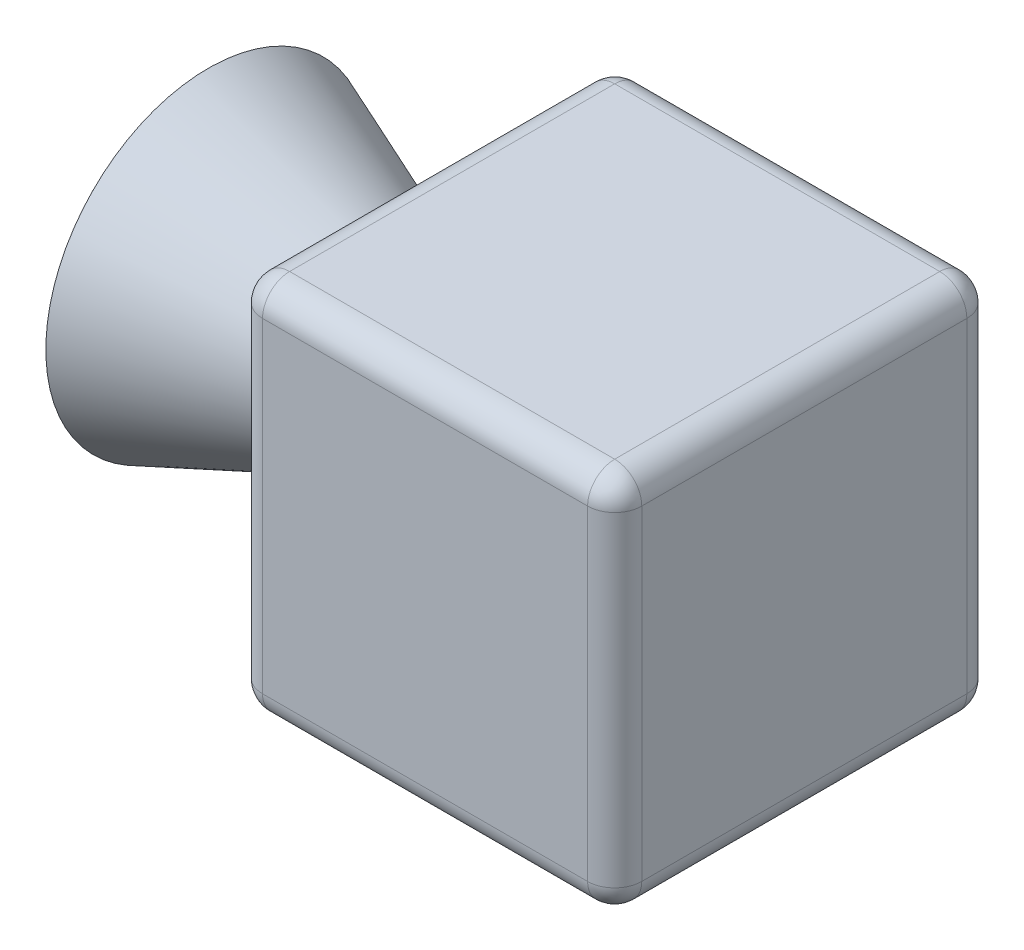
ISO-10303-21;
HEADER;
FILE_DESCRIPTION(('STEP AP214'),'2;1');
FILE_NAME('part.step','',(''),(''),'','','');
FILE_SCHEMA(('AUTOMOTIVE_DESIGN { 1 0 10303 214 1 1 1 1 }'));
ENDSEC;
DATA;
#1=APPLICATION_CONTEXT('core data for automotive mechanical design processes');
#2=APPLICATION_PROTOCOL_DEFINITION('international standard','automotive_design',2000,#1);
#3=PRODUCT_CONTEXT('',#1,'mechanical');
#4=PRODUCT('Part','Part','',(#3));
#5=PRODUCT_RELATED_PRODUCT_CATEGORY('part','',(#4));
#6=PRODUCT_DEFINITION_FORMATION('','',#4);
#7=PRODUCT_DEFINITION_CONTEXT('part definition',#1,'design');
#8=PRODUCT_DEFINITION('design','',#6,#7);
#9=PRODUCT_DEFINITION_SHAPE('','',#8);
#10=(LENGTH_UNIT() NAMED_UNIT(*) SI_UNIT(.MILLI.,.METRE.));
#11=(NAMED_UNIT(*) PLANE_ANGLE_UNIT() SI_UNIT($,.RADIAN.));
#12=(NAMED_UNIT(*) SI_UNIT($,.STERADIAN.) SOLID_ANGLE_UNIT());
#13=UNCERTAINTY_MEASURE_WITH_UNIT(LENGTH_MEASURE(1.E-05),#10,'distance_accuracy_value','');
#14=(GEOMETRIC_REPRESENTATION_CONTEXT(3) GLOBAL_UNCERTAINTY_ASSIGNED_CONTEXT((#13)) GLOBAL_UNIT_ASSIGNED_CONTEXT((#10,
#11,#12)) REPRESENTATION_CONTEXT('',''));
#15=CARTESIAN_POINT('',(0.,0.,0.));
#16=DIRECTION('',(0.,0.,1.));
#17=DIRECTION('',(1.,0.,0.));
#18=AXIS2_PLACEMENT_3D('',#15,#16,#17);
#19=CARTESIAN_POINT('',(-7.,0.,0.));
#20=DIRECTION('',(-1.,0.,0.));
#21=DIRECTION('',(0.,0.,1.));
#22=AXIS2_PLACEMENT_3D('',#19,#20,#21);
#23=CONICAL_SURFACE('',#22,2.8,0.380506377112365);
#24=CARTESIAN_POINT('',(-15.,0.,0.));
#25=DIRECTION('',(1.,0.,0.));
#26=DIRECTION('',(0.,0.,-1.));
#27=AXIS2_PLACEMENT_3D('',#24,#25,#26);
#28=CIRCLE('',#27,6.);
#29=CARTESIAN_POINT('',(-15.,0.,-6.));
#30=VERTEX_POINT('',#29);
#31=EDGE_CURVE('E155',#30,#30,#28,.T.);
#32=ORIENTED_EDGE('',*,*,#31,.T.);
#33=EDGE_LOOP('',(#32));
#34=FACE_BOUND('',#33,.T.);
#35=CARTESIAN_POINT('',(-7.,0.,0.));
#36=DIRECTION('',(1.,0.,0.));
#37=DIRECTION('',(0.,0.,-1.));
#38=AXIS2_PLACEMENT_3D('',#35,#36,#37);
#39=CIRCLE('',#38,2.8);
#40=CARTESIAN_POINT('',(-7.,0.,-2.8));
#41=VERTEX_POINT('',#40);
#42=EDGE_CURVE('E261',#41,#41,#39,.T.);
#43=ORIENTED_EDGE('',*,*,#42,.F.);
#44=EDGE_LOOP('',(#43));
#45=FACE_BOUND('',#44,.T.);
#46=ADVANCED_FACE('F38',(#34,#45),#23,.T.);
#47=CARTESIAN_POINT('',(-7.,0.,0.));
#48=DIRECTION('',(1.,0.,0.));
#49=DIRECTION('',(0.,0.,-1.));
#50=AXIS2_PLACEMENT_3D('',#47,#48,#49);
#51=SPHERICAL_SURFACE('',#50,10.);
#52=ORIENTED_EDGE('',*,*,#31,.F.);
#53=EDGE_LOOP('',(#52));
#54=FACE_BOUND('',#53,.T.);
#55=ADVANCED_FACE('F275',(#54),#51,.T.);
#56=CARTESIAN_POINT('',(0.,7.,7.));
#57=DIRECTION('',(0.,0.,-1.));
#58=DIRECTION('',(-1.,0.,0.));
#59=AXIS2_PLACEMENT_3D('',#56,#57,#58);
#60=PLANE('',#59);
#61=DIRECTION('',(1.,0.,0.));
#62=VECTOR('',#61,1.);
#63=CARTESIAN_POINT('',(-7.,6.,7.));
#64=LINE('',#63,#62);
#65=CARTESIAN_POINT('',(6.,6.,7.));
#66=VERTEX_POINT('',#65);
#67=CARTESIAN_POINT('',(-6.,6.,7.));
#68=VERTEX_POINT('',#67);
#69=EDGE_CURVE('E195',#66,#68,#64,.F.);
#70=ORIENTED_EDGE('',*,*,#69,.T.);
#71=DIRECTION('',(0.,-1.,0.));
#72=VECTOR('',#71,1.);
#73=CARTESIAN_POINT('',(-6.,-7.,7.));
#74=LINE('',#73,#72);
#75=CARTESIAN_POINT('',(-6.,-6.,7.));
#76=VERTEX_POINT('',#75);
#77=EDGE_CURVE('E197',#68,#76,#74,.T.);
#78=ORIENTED_EDGE('',*,*,#77,.T.);
#79=DIRECTION('',(1.,0.,0.));
#80=VECTOR('',#79,1.);
#81=CARTESIAN_POINT('',(0.,-6.,7.));
#82=LINE('',#81,#80);
#83=CARTESIAN_POINT('',(6.,-6.,7.));
#84=VERTEX_POINT('',#83);
#85=EDGE_CURVE('E191',#76,#84,#82,.T.);
#86=ORIENTED_EDGE('',*,*,#85,.T.);
#87=DIRECTION('',(0.,-1.,0.));
#88=VECTOR('',#87,1.);
#89=CARTESIAN_POINT('',(6.,7.,7.));
#90=LINE('',#89,#88);
#91=EDGE_CURVE('E193',#84,#66,#90,.F.);
#92=ORIENTED_EDGE('',*,*,#91,.T.);
#93=EDGE_LOOP('',(#70,#78,#86,#92));
#94=FACE_BOUND('',#93,.T.);
#95=ADVANCED_FACE('F277',(#94),#60,.F.);
#96=CARTESIAN_POINT('',(7.,7.,0.));
#97=DIRECTION('',(-1.,0.,0.));
#98=DIRECTION('',(0.,0.,1.));
#99=AXIS2_PLACEMENT_3D('',#96,#97,#98);
#100=PLANE('',#99);
#101=DIRECTION('',(0.,0.,-1.));
#102=VECTOR('',#101,1.);
#103=CARTESIAN_POINT('',(7.,6.,7.));
#104=LINE('',#103,#102);
#105=CARTESIAN_POINT('',(7.,6.,-6.));
#106=VERTEX_POINT('',#105);
#107=CARTESIAN_POINT('',(7.,6.,6.));
#108=VERTEX_POINT('',#107);
#109=EDGE_CURVE('E177',#106,#108,#104,.F.);
#110=ORIENTED_EDGE('',*,*,#109,.T.);
#111=DIRECTION('',(0.,-1.,0.));
#112=VECTOR('',#111,1.);
#113=CARTESIAN_POINT('',(7.,7.,6.));
#114=LINE('',#113,#112);
#115=CARTESIAN_POINT('',(7.,-6.,6.));
#116=VERTEX_POINT('',#115);
#117=EDGE_CURVE('E180',#108,#116,#114,.T.);
#118=ORIENTED_EDGE('',*,*,#117,.T.);
#119=DIRECTION('',(0.,0.,-1.));
#120=VECTOR('',#119,1.);
#121=CARTESIAN_POINT('',(7.,-6.,0.));
#122=LINE('',#121,#120);
#123=CARTESIAN_POINT('',(7.,-6.,-6.));
#124=VERTEX_POINT('',#123);
#125=EDGE_CURVE('E175',#116,#124,#122,.T.);
#126=ORIENTED_EDGE('',*,*,#125,.T.);
#127=DIRECTION('',(0.,-1.,0.));
#128=VECTOR('',#127,1.);
#129=CARTESIAN_POINT('',(7.,7.,-6.));
#130=LINE('',#129,#128);
#131=EDGE_CURVE('E173',#124,#106,#130,.F.);
#132=ORIENTED_EDGE('',*,*,#131,.T.);
#133=EDGE_LOOP('',(#110,#118,#126,#132));
#134=FACE_BOUND('',#133,.T.);
#135=ADVANCED_FACE('F283',(#134),#100,.F.);
#136=CARTESIAN_POINT('',(0.,7.,-7.));
#137=DIRECTION('',(0.,0.,-1.));
#138=DIRECTION('',(-1.,0.,0.));
#139=AXIS2_PLACEMENT_3D('',#136,#137,#138);
#140=PLANE('',#139);
#141=DIRECTION('',(1.,0.,0.));
#142=VECTOR('',#141,1.);
#143=CARTESIAN_POINT('',(0.,6.,-7.));
#144=LINE('',#143,#142);
#145=CARTESIAN_POINT('',(-6.,6.,-7.));
#146=VERTEX_POINT('',#145);
#147=CARTESIAN_POINT('',(6.,6.,-7.));
#148=VERTEX_POINT('',#147);
#149=EDGE_CURVE('E47',#146,#148,#144,.T.);
#150=ORIENTED_EDGE('',*,*,#149,.T.);
#151=DIRECTION('',(0.,-1.,0.));
#152=VECTOR('',#151,1.);
#153=CARTESIAN_POINT('',(6.,-7.,-7.));
#154=LINE('',#153,#152);
#155=CARTESIAN_POINT('',(6.,-6.,-7.));
#156=VERTEX_POINT('',#155);
#157=EDGE_CURVE('E11',#148,#156,#154,.T.);
#158=ORIENTED_EDGE('',*,*,#157,.T.);
#159=DIRECTION('',(1.,0.,0.));
#160=VECTOR('',#159,1.);
#161=CARTESIAN_POINT('',(-7.,-6.,-7.));
#162=LINE('',#161,#160);
#163=CARTESIAN_POINT('',(-6.,-6.,-7.));
#164=VERTEX_POINT('',#163);
#165=EDGE_CURVE('E200',#156,#164,#162,.F.);
#166=ORIENTED_EDGE('',*,*,#165,.T.);
#167=DIRECTION('',(0.,-1.,0.));
#168=VECTOR('',#167,1.);
#169=CARTESIAN_POINT('',(-6.,7.,-7.));
#170=LINE('',#169,#168);
#171=EDGE_CURVE('E58',#164,#146,#170,.F.);
#172=ORIENTED_EDGE('',*,*,#171,.T.);
#173=EDGE_LOOP('',(#150,#158,#166,#172));
#174=FACE_BOUND('',#173,.T.);
#175=ADVANCED_FACE('F386',(#174),#140,.T.);
#176=CARTESIAN_POINT('',(-7.,7.,0.));
#177=DIRECTION('',(-1.,0.,0.));
#178=DIRECTION('',(0.,0.,1.));
#179=AXIS2_PLACEMENT_3D('',#176,#177,#178);
#180=PLANE('',#179);
#181=DIRECTION('',(0.,0.,-1.));
#182=VECTOR('',#181,1.);
#183=CARTESIAN_POINT('',(-7.,-6.,7.));
#184=LINE('',#183,#182);
#185=CARTESIAN_POINT('',(-7.,-6.,-6.));
#186=VERTEX_POINT('',#185);
#187=CARTESIAN_POINT('',(-7.,-6.,6.));
#188=VERTEX_POINT('',#187);
#189=EDGE_CURVE('E154',#186,#188,#184,.F.);
#190=ORIENTED_EDGE('',*,*,#189,.T.);
#191=DIRECTION('',(0.,-1.,0.));
#192=VECTOR('',#191,1.);
#193=CARTESIAN_POINT('',(-7.,7.,6.));
#194=LINE('',#193,#192);
#195=CARTESIAN_POINT('',(-7.,6.,6.));
#196=VERTEX_POINT('',#195);
#197=EDGE_CURVE('E160',#188,#196,#194,.F.);
#198=ORIENTED_EDGE('',*,*,#197,.T.);
#199=DIRECTION('',(0.,0.,-1.));
#200=VECTOR('',#199,1.);
#201=CARTESIAN_POINT('',(-7.,6.,0.));
#202=LINE('',#201,#200);
#203=CARTESIAN_POINT('',(-7.,6.,-6.));
#204=VERTEX_POINT('',#203);
#205=EDGE_CURVE('E131',#196,#204,#202,.T.);
#206=ORIENTED_EDGE('',*,*,#205,.T.);
#207=DIRECTION('',(0.,-1.,0.));
#208=VECTOR('',#207,1.);
#209=CARTESIAN_POINT('',(-7.,7.,-6.));
#210=LINE('',#209,#208);
#211=EDGE_CURVE('E148',#204,#186,#210,.T.);
#212=ORIENTED_EDGE('',*,*,#211,.T.);
#213=EDGE_LOOP('',(#190,#198,#206,#212));
#214=FACE_BOUND('',#213,.T.);
#215=ORIENTED_EDGE('',*,*,#42,.T.);
#216=EDGE_LOOP('',(#215));
#217=FACE_BOUND('',#216,.T.);
#218=ADVANCED_FACE('F157',(#214,#217),#180,.T.);
#219=CARTESIAN_POINT('',(0.,7.,0.));
#220=DIRECTION('',(0.,1.,0.));
#221=DIRECTION('',(0.,0.,1.));
#222=AXIS2_PLACEMENT_3D('',#219,#220,#221);
#223=PLANE('',#222);
#224=DIRECTION('',(0.,0.,-1.));
#225=VECTOR('',#224,1.);
#226=CARTESIAN_POINT('',(-6.,7.,0.));
#227=LINE('',#226,#225);
#228=CARTESIAN_POINT('',(-6.,7.,-6.));
#229=VERTEX_POINT('',#228);
#230=CARTESIAN_POINT('',(-6.,7.,6.));
#231=VERTEX_POINT('',#230);
#232=EDGE_CURVE('E133',#229,#231,#227,.F.);
#233=ORIENTED_EDGE('',*,*,#232,.T.);
#234=DIRECTION('',(1.,0.,0.));
#235=VECTOR('',#234,1.);
#236=CARTESIAN_POINT('',(7.,7.,6.));
#237=LINE('',#236,#235);
#238=CARTESIAN_POINT('',(6.,7.,6.));
#239=VERTEX_POINT('',#238);
#240=EDGE_CURVE('E171',#231,#239,#237,.T.);
#241=ORIENTED_EDGE('',*,*,#240,.T.);
#242=DIRECTION('',(0.,0.,-1.));
#243=VECTOR('',#242,1.);
#244=CARTESIAN_POINT('',(6.,7.,-7.));
#245=LINE('',#244,#243);
#246=CARTESIAN_POINT('',(6.,7.,-6.));
#247=VERTEX_POINT('',#246);
#248=EDGE_CURVE('E168',#239,#247,#245,.T.);
#249=ORIENTED_EDGE('',*,*,#248,.T.);
#250=DIRECTION('',(1.,0.,0.));
#251=VECTOR('',#250,1.);
#252=CARTESIAN_POINT('',(0.,7.,-6.));
#253=LINE('',#252,#251);
#254=EDGE_CURVE('E163',#247,#229,#253,.F.);
#255=ORIENTED_EDGE('',*,*,#254,.T.);
#256=EDGE_LOOP('',(#233,#241,#249,#255));
#257=FACE_BOUND('',#256,.T.);
#258=ADVANCED_FACE('F380',(#257),#223,.T.);
#259=CARTESIAN_POINT('',(0.,-7.,0.));
#260=DIRECTION('',(0.,1.,0.));
#261=DIRECTION('',(0.,0.,1.));
#262=AXIS2_PLACEMENT_3D('',#259,#260,#261);
#263=PLANE('',#262);
#264=DIRECTION('',(0.,0.,-1.));
#265=VECTOR('',#264,1.);
#266=CARTESIAN_POINT('',(6.,-7.,0.));
#267=LINE('',#266,#265);
#268=CARTESIAN_POINT('',(6.,-7.,-6.));
#269=VERTEX_POINT('',#268);
#270=CARTESIAN_POINT('',(6.,-7.,6.));
#271=VERTEX_POINT('',#270);
#272=EDGE_CURVE('E186',#269,#271,#267,.F.);
#273=ORIENTED_EDGE('',*,*,#272,.T.);
#274=DIRECTION('',(1.,0.,0.));
#275=VECTOR('',#274,1.);
#276=CARTESIAN_POINT('',(0.,-7.,6.));
#277=LINE('',#276,#275);
#278=CARTESIAN_POINT('',(-6.,-7.,6.));
#279=VERTEX_POINT('',#278);
#280=EDGE_CURVE('E189',#271,#279,#277,.F.);
#281=ORIENTED_EDGE('',*,*,#280,.T.);
#282=DIRECTION('',(0.,0.,-1.));
#283=VECTOR('',#282,1.);
#284=CARTESIAN_POINT('',(-6.,-7.,-7.));
#285=LINE('',#284,#283);
#286=CARTESIAN_POINT('',(-6.,-7.,-6.));
#287=VERTEX_POINT('',#286);
#288=EDGE_CURVE('E184',#279,#287,#285,.T.);
#289=ORIENTED_EDGE('',*,*,#288,.T.);
#290=DIRECTION('',(1.,0.,0.));
#291=VECTOR('',#290,1.);
#292=CARTESIAN_POINT('',(7.,-7.,-6.));
#293=LINE('',#292,#291);
#294=EDGE_CURVE('E182',#287,#269,#293,.T.);
#295=ORIENTED_EDGE('',*,*,#294,.T.);
#296=EDGE_LOOP('',(#273,#281,#289,#295));
#297=FACE_BOUND('',#296,.T.);
#298=ADVANCED_FACE('F358',(#297),#263,.F.);
#299=CARTESIAN_POINT('',(6.,-6.,0.));
#300=DIRECTION('',(0.,0.,-1.));
#301=DIRECTION('',(-1.,0.,0.));
#302=AXIS2_PLACEMENT_3D('',#299,#300,#301);
#303=CYLINDRICAL_SURFACE('',#302,1.);
#304=CARTESIAN_POINT('',(6.,-6.,6.));
#305=DIRECTION('',(0.,0.,1.));
#306=DIRECTION('',(1.,0.,0.));
#307=AXIS2_PLACEMENT_3D('',#304,#305,#306);
#308=CIRCLE('',#307,1.);
#309=EDGE_CURVE('E42',#271,#116,#308,.T.);
#310=ORIENTED_EDGE('',*,*,#309,.F.);
#311=ORIENTED_EDGE('',*,*,#272,.F.);
#312=CARTESIAN_POINT('',(6.,-6.,-6.));
#313=DIRECTION('',(0.,0.,-1.));
#314=DIRECTION('',(-1.,0.,0.));
#315=AXIS2_PLACEMENT_3D('',#312,#313,#314);
#316=CIRCLE('',#315,1.);
#317=EDGE_CURVE('E254',#124,#269,#316,.T.);
#318=ORIENTED_EDGE('',*,*,#317,.F.);
#319=ORIENTED_EDGE('',*,*,#125,.F.);
#320=EDGE_LOOP('',(#310,#311,#318,#319));
#321=FACE_BOUND('',#320,.T.);
#322=ADVANCED_FACE('F40',(#321),#303,.T.);
#323=CARTESIAN_POINT('',(6.,-6.,6.));
#324=DIRECTION('',(0.,0.,1.));
#325=DIRECTION('',(1.,0.,0.));
#326=AXIS2_PLACEMENT_3D('',#323,#324,#325);
#327=SPHERICAL_SURFACE('',#326,1.);
#328=CARTESIAN_POINT('',(6.,-6.,6.));
#329=DIRECTION('',(1.,0.,0.));
#330=DIRECTION('',(0.,0.,-1.));
#331=AXIS2_PLACEMENT_3D('',#328,#329,#330);
#332=CIRCLE('',#331,1.);
#333=EDGE_CURVE('E249',#271,#84,#332,.F.);
#334=ORIENTED_EDGE('',*,*,#333,.F.);
#335=ORIENTED_EDGE('',*,*,#309,.T.);
#336=CARTESIAN_POINT('',(6.,-6.,6.));
#337=DIRECTION('',(0.,-1.,0.));
#338=DIRECTION('',(0.,0.,-1.));
#339=AXIS2_PLACEMENT_3D('',#336,#337,#338);
#340=CIRCLE('',#339,1.);
#341=EDGE_CURVE('E252',#84,#116,#340,.F.);
#342=ORIENTED_EDGE('',*,*,#341,.F.);
#343=EDGE_LOOP('',(#334,#335,#342));
#344=FACE_BOUND('',#343,.T.);
#345=ADVANCED_FACE('F353',(#344),#327,.T.);
#346=CARTESIAN_POINT('',(6.,-6.,-6.));
#347=DIRECTION('',(0.,0.,1.));
#348=DIRECTION('',(1.,0.,0.));
#349=AXIS2_PLACEMENT_3D('',#346,#347,#348);
#350=SPHERICAL_SURFACE('',#349,1.);
#351=CARTESIAN_POINT('',(6.,-6.,-6.));
#352=DIRECTION('',(0.,-1.,0.));
#353=DIRECTION('',(1.,0.,0.));
#354=AXIS2_PLACEMENT_3D('',#351,#352,#353);
#355=CIRCLE('',#354,1.);
#356=EDGE_CURVE('E243',#124,#156,#355,.F.);
#357=ORIENTED_EDGE('',*,*,#356,.F.);
#358=ORIENTED_EDGE('',*,*,#317,.T.);
#359=CARTESIAN_POINT('',(6.,-6.,-6.));
#360=DIRECTION('',(1.,0.,0.));
#361=DIRECTION('',(0.,0.,-1.));
#362=AXIS2_PLACEMENT_3D('',#359,#360,#361);
#363=CIRCLE('',#362,1.);
#364=EDGE_CURVE('E246',#156,#269,#363,.F.);
#365=ORIENTED_EDGE('',*,*,#364,.F.);
#366=EDGE_LOOP('',(#357,#358,#365));
#367=FACE_BOUND('',#366,.T.);
#368=ADVANCED_FACE('F350',(#367),#350,.T.);
#369=CARTESIAN_POINT('',(6.,7.,6.));
#370=DIRECTION('',(0.,-1.,0.));
#371=DIRECTION('',(0.,0.,-1.));
#372=AXIS2_PLACEMENT_3D('',#369,#370,#371);
#373=CYLINDRICAL_SURFACE('',#372,1.);
#374=ORIENTED_EDGE('',*,*,#341,.T.);
#375=ORIENTED_EDGE('',*,*,#117,.F.);
#376=CARTESIAN_POINT('',(6.,6.,6.));
#377=DIRECTION('',(0.,1.,0.));
#378=DIRECTION('',(0.,0.,1.));
#379=AXIS2_PLACEMENT_3D('',#376,#377,#378);
#380=CIRCLE('',#379,1.);
#381=EDGE_CURVE('E238',#66,#108,#380,.T.);
#382=ORIENTED_EDGE('',*,*,#381,.F.);
#383=ORIENTED_EDGE('',*,*,#91,.F.);
#384=EDGE_LOOP('',(#374,#375,#382,#383));
#385=FACE_BOUND('',#384,.T.);
#386=ADVANCED_FACE('F346',(#385),#373,.T.);
#387=CARTESIAN_POINT('',(0.,-6.,6.));
#388=DIRECTION('',(1.,0.,0.));
#389=DIRECTION('',(0.,0.,-1.));
#390=AXIS2_PLACEMENT_3D('',#387,#388,#389);
#391=CYLINDRICAL_SURFACE('',#390,1.);
#392=ORIENTED_EDGE('',*,*,#333,.T.);
#393=ORIENTED_EDGE('',*,*,#85,.F.);
#394=CARTESIAN_POINT('',(-6.,-6.,6.));
#395=DIRECTION('',(-1.,0.,0.));
#396=DIRECTION('',(0.,0.,1.));
#397=AXIS2_PLACEMENT_3D('',#394,#395,#396);
#398=CIRCLE('',#397,1.);
#399=EDGE_CURVE('E235',#279,#76,#398,.T.);
#400=ORIENTED_EDGE('',*,*,#399,.F.);
#401=ORIENTED_EDGE('',*,*,#280,.F.);
#402=EDGE_LOOP('',(#392,#393,#400,#401));
#403=FACE_BOUND('',#402,.T.);
#404=ADVANCED_FACE('F342',(#403),#391,.T.);
#405=CARTESIAN_POINT('',(-6.,-6.,0.));
#406=DIRECTION('',(0.,0.,1.));
#407=DIRECTION('',(1.,0.,0.));
#408=AXIS2_PLACEMENT_3D('',#405,#406,#407);
#409=CYLINDRICAL_SURFACE('',#408,1.);
#410=CARTESIAN_POINT('',(-6.,-6.,-6.));
#411=DIRECTION('',(0.,0.,-1.));
#412=DIRECTION('',(-1.,0.,0.));
#413=AXIS2_PLACEMENT_3D('',#410,#411,#412);
#414=CIRCLE('',#413,1.);
#415=EDGE_CURVE('E229',#287,#186,#414,.T.);
#416=ORIENTED_EDGE('',*,*,#415,.F.);
#417=ORIENTED_EDGE('',*,*,#288,.F.);
#418=CARTESIAN_POINT('',(-6.,-6.,6.));
#419=DIRECTION('',(0.,0.,1.));
#420=DIRECTION('',(1.,0.,0.));
#421=AXIS2_PLACEMENT_3D('',#418,#419,#420);
#422=CIRCLE('',#421,1.);
#423=EDGE_CURVE('E232',#188,#279,#422,.T.);
#424=ORIENTED_EDGE('',*,*,#423,.F.);
#425=ORIENTED_EDGE('',*,*,#189,.F.);
#426=EDGE_LOOP('',(#416,#417,#424,#425));
#427=FACE_BOUND('',#426,.T.);
#428=ADVANCED_FACE('F338',(#427),#409,.T.);
#429=CARTESIAN_POINT('',(0.,-6.,-6.));
#430=DIRECTION('',(-1.,0.,0.));
#431=DIRECTION('',(0.,0.,1.));
#432=AXIS2_PLACEMENT_3D('',#429,#430,#431);
#433=CYLINDRICAL_SURFACE('',#432,1.);
#434=ORIENTED_EDGE('',*,*,#364,.T.);
#435=ORIENTED_EDGE('',*,*,#294,.F.);
#436=CARTESIAN_POINT('',(-6.,-6.,-6.));
#437=DIRECTION('',(-1.,0.,0.));
#438=DIRECTION('',(0.,0.,1.));
#439=AXIS2_PLACEMENT_3D('',#436,#437,#438);
#440=CIRCLE('',#439,1.);
#441=EDGE_CURVE('E226',#164,#287,#440,.T.);
#442=ORIENTED_EDGE('',*,*,#441,.F.);
#443=ORIENTED_EDGE('',*,*,#165,.F.);
#444=EDGE_LOOP('',(#434,#435,#442,#443));
#445=FACE_BOUND('',#444,.T.);
#446=ADVANCED_FACE('F334',(#445),#433,.T.);
#447=CARTESIAN_POINT('',(6.,7.,-6.));
#448=DIRECTION('',(0.,1.,0.));
#449=DIRECTION('',(0.,0.,1.));
#450=AXIS2_PLACEMENT_3D('',#447,#448,#449);
#451=CYLINDRICAL_SURFACE('',#450,1.);
#452=ORIENTED_EDGE('',*,*,#356,.T.);
#453=ORIENTED_EDGE('',*,*,#157,.F.);
#454=CARTESIAN_POINT('',(6.,6.,-6.));
#455=DIRECTION('',(0.,1.,0.));
#456=DIRECTION('',(0.,0.,1.));
#457=AXIS2_PLACEMENT_3D('',#454,#455,#456);
#458=CIRCLE('',#457,1.);
#459=EDGE_CURVE('E223',#106,#148,#458,.T.);
#460=ORIENTED_EDGE('',*,*,#459,.F.);
#461=ORIENTED_EDGE('',*,*,#131,.F.);
#462=EDGE_LOOP('',(#452,#453,#460,#461));
#463=FACE_BOUND('',#462,.T.);
#464=ADVANCED_FACE('F330',(#463),#451,.T.);
#465=CARTESIAN_POINT('',(6.,6.,0.));
#466=DIRECTION('',(0.,0.,1.));
#467=DIRECTION('',(1.,0.,0.));
#468=AXIS2_PLACEMENT_3D('',#465,#466,#467);
#469=CYLINDRICAL_SURFACE('',#468,1.);
#470=CARTESIAN_POINT('',(6.,6.,6.));
#471=DIRECTION('',(0.,0.,1.));
#472=DIRECTION('',(1.,0.,0.));
#473=AXIS2_PLACEMENT_3D('',#470,#471,#472);
#474=CIRCLE('',#473,1.);
#475=EDGE_CURVE('E240',#108,#239,#474,.T.);
#476=ORIENTED_EDGE('',*,*,#475,.F.);
#477=ORIENTED_EDGE('',*,*,#109,.F.);
#478=CARTESIAN_POINT('',(6.,6.,-6.));
#479=DIRECTION('',(0.,0.,-1.));
#480=DIRECTION('',(-1.,0.,0.));
#481=AXIS2_PLACEMENT_3D('',#478,#479,#480);
#482=CIRCLE('',#481,1.);
#483=EDGE_CURVE('E220',#247,#106,#482,.T.);
#484=ORIENTED_EDGE('',*,*,#483,.F.);
#485=ORIENTED_EDGE('',*,*,#248,.F.);
#486=EDGE_LOOP('',(#476,#477,#484,#485));
#487=FACE_BOUND('',#486,.T.);
#488=ADVANCED_FACE('F326',(#487),#469,.T.);
#489=CARTESIAN_POINT('',(6.,6.,6.));
#490=DIRECTION('',(0.,0.,1.));
#491=DIRECTION('',(1.,0.,0.));
#492=AXIS2_PLACEMENT_3D('',#489,#490,#491);
#493=SPHERICAL_SURFACE('',#492,1.);
#494=ORIENTED_EDGE('',*,*,#381,.T.);
#495=ORIENTED_EDGE('',*,*,#475,.T.);
#496=CARTESIAN_POINT('',(6.,6.,6.));
#497=DIRECTION('',(1.,0.,0.));
#498=DIRECTION('',(0.,0.,-1.));
#499=AXIS2_PLACEMENT_3D('',#496,#497,#498);
#500=CIRCLE('',#499,1.);
#501=EDGE_CURVE('E217',#66,#239,#500,.F.);
#502=ORIENTED_EDGE('',*,*,#501,.F.);
#503=EDGE_LOOP('',(#494,#495,#502));
#504=FACE_BOUND('',#503,.T.);
#505=ADVANCED_FACE('F322',(#504),#493,.T.);
#506=CARTESIAN_POINT('',(-6.,-6.,6.));
#507=DIRECTION('',(0.,0.,1.));
#508=DIRECTION('',(1.,0.,0.));
#509=AXIS2_PLACEMENT_3D('',#506,#507,#508);
#510=SPHERICAL_SURFACE('',#509,1.);
#511=ORIENTED_EDGE('',*,*,#423,.T.);
#512=ORIENTED_EDGE('',*,*,#399,.T.);
#513=CARTESIAN_POINT('',(-6.,-6.,6.));
#514=DIRECTION('',(0.,-1.,0.));
#515=DIRECTION('',(1.,0.,0.));
#516=AXIS2_PLACEMENT_3D('',#513,#514,#515);
#517=CIRCLE('',#516,1.);
#518=EDGE_CURVE('E215',#188,#76,#517,.F.);
#519=ORIENTED_EDGE('',*,*,#518,.F.);
#520=EDGE_LOOP('',(#511,#512,#519));
#521=FACE_BOUND('',#520,.T.);
#522=ADVANCED_FACE('F318',(#521),#510,.T.);
#523=CARTESIAN_POINT('',(-6.,-6.,-6.));
#524=DIRECTION('',(0.,0.,1.));
#525=DIRECTION('',(1.,0.,0.));
#526=AXIS2_PLACEMENT_3D('',#523,#524,#525);
#527=SPHERICAL_SURFACE('',#526,1.);
#528=ORIENTED_EDGE('',*,*,#441,.T.);
#529=ORIENTED_EDGE('',*,*,#415,.T.);
#530=CARTESIAN_POINT('',(-6.,-6.,-6.));
#531=DIRECTION('',(0.,-1.,0.));
#532=DIRECTION('',(0.,0.,-1.));
#533=AXIS2_PLACEMENT_3D('',#530,#531,#532);
#534=CIRCLE('',#533,1.);
#535=EDGE_CURVE('E151',#164,#186,#534,.F.);
#536=ORIENTED_EDGE('',*,*,#535,.F.);
#537=EDGE_LOOP('',(#528,#529,#536));
#538=FACE_BOUND('',#537,.T.);
#539=ADVANCED_FACE('F314',(#538),#527,.T.);
#540=CARTESIAN_POINT('',(6.,6.,-6.));
#541=DIRECTION('',(0.,0.,1.));
#542=DIRECTION('',(1.,0.,0.));
#543=AXIS2_PLACEMENT_3D('',#540,#541,#542);
#544=SPHERICAL_SURFACE('',#543,1.);
#545=ORIENTED_EDGE('',*,*,#483,.T.);
#546=ORIENTED_EDGE('',*,*,#459,.T.);
#547=CARTESIAN_POINT('',(6.,6.,-6.));
#548=DIRECTION('',(1.,0.,0.));
#549=DIRECTION('',(0.,0.,-1.));
#550=AXIS2_PLACEMENT_3D('',#547,#548,#549);
#551=CIRCLE('',#550,1.);
#552=EDGE_CURVE('E211',#247,#148,#551,.F.);
#553=ORIENTED_EDGE('',*,*,#552,.F.);
#554=EDGE_LOOP('',(#545,#546,#553));
#555=FACE_BOUND('',#554,.T.);
#556=ADVANCED_FACE('F310',(#555),#544,.T.);
#557=CARTESIAN_POINT('',(0.,6.,6.));
#558=DIRECTION('',(-1.,0.,0.));
#559=DIRECTION('',(0.,0.,1.));
#560=AXIS2_PLACEMENT_3D('',#557,#558,#559);
#561=CYLINDRICAL_SURFACE('',#560,1.);
#562=ORIENTED_EDGE('',*,*,#501,.T.);
#563=ORIENTED_EDGE('',*,*,#240,.F.);
#564=CARTESIAN_POINT('',(-6.,6.,6.));
#565=DIRECTION('',(-1.,0.,0.));
#566=DIRECTION('',(0.,0.,1.));
#567=AXIS2_PLACEMENT_3D('',#564,#565,#566);
#568=CIRCLE('',#567,1.);
#569=EDGE_CURVE('E208',#68,#231,#568,.T.);
#570=ORIENTED_EDGE('',*,*,#569,.F.);
#571=ORIENTED_EDGE('',*,*,#69,.F.);
#572=EDGE_LOOP('',(#562,#563,#570,#571));
#573=FACE_BOUND('',#572,.T.);
#574=ADVANCED_FACE('F306',(#573),#561,.T.);
#575=CARTESIAN_POINT('',(-6.,7.,6.));
#576=DIRECTION('',(0.,1.,0.));
#577=DIRECTION('',(0.,0.,1.));
#578=AXIS2_PLACEMENT_3D('',#575,#576,#577);
#579=CYLINDRICAL_SURFACE('',#578,1.);
#580=ORIENTED_EDGE('',*,*,#518,.T.);
#581=ORIENTED_EDGE('',*,*,#77,.F.);
#582=CARTESIAN_POINT('',(-6.,6.,6.));
#583=DIRECTION('',(0.,1.,0.));
#584=DIRECTION('',(0.,0.,1.));
#585=AXIS2_PLACEMENT_3D('',#582,#583,#584);
#586=CIRCLE('',#585,1.);
#587=EDGE_CURVE('E145',#196,#68,#586,.T.);
#588=ORIENTED_EDGE('',*,*,#587,.F.);
#589=ORIENTED_EDGE('',*,*,#197,.F.);
#590=EDGE_LOOP('',(#580,#581,#588,#589));
#591=FACE_BOUND('',#590,.T.);
#592=ADVANCED_FACE('F303',(#591),#579,.T.);
#593=CARTESIAN_POINT('',(-6.,7.,-6.));
#594=DIRECTION('',(0.,-1.,0.));
#595=DIRECTION('',(0.,0.,-1.));
#596=AXIS2_PLACEMENT_3D('',#593,#594,#595);
#597=CYLINDRICAL_SURFACE('',#596,1.);
#598=ORIENTED_EDGE('',*,*,#535,.T.);
#599=ORIENTED_EDGE('',*,*,#211,.F.);
#600=CARTESIAN_POINT('',(-6.,6.,-6.));
#601=DIRECTION('',(0.,1.,0.));
#602=DIRECTION('',(0.,0.,1.));
#603=AXIS2_PLACEMENT_3D('',#600,#601,#602);
#604=CIRCLE('',#603,1.);
#605=EDGE_CURVE('E139',#146,#204,#604,.T.);
#606=ORIENTED_EDGE('',*,*,#605,.F.);
#607=ORIENTED_EDGE('',*,*,#171,.F.);
#608=EDGE_LOOP('',(#598,#599,#606,#607));
#609=FACE_BOUND('',#608,.T.);
#610=ADVANCED_FACE('F149',(#609),#597,.T.);
#611=CARTESIAN_POINT('',(0.,6.,-6.));
#612=DIRECTION('',(1.,0.,0.));
#613=DIRECTION('',(0.,0.,-1.));
#614=AXIS2_PLACEMENT_3D('',#611,#612,#613);
#615=CYLINDRICAL_SURFACE('',#614,1.);
#616=ORIENTED_EDGE('',*,*,#552,.T.);
#617=ORIENTED_EDGE('',*,*,#149,.F.);
#618=CARTESIAN_POINT('',(-6.,6.,-6.));
#619=DIRECTION('',(-1.,0.,0.));
#620=DIRECTION('',(0.,0.,1.));
#621=AXIS2_PLACEMENT_3D('',#618,#619,#620);
#622=CIRCLE('',#621,1.);
#623=EDGE_CURVE('E143',#229,#146,#622,.T.);
#624=ORIENTED_EDGE('',*,*,#623,.F.);
#625=ORIENTED_EDGE('',*,*,#254,.F.);
#626=EDGE_LOOP('',(#616,#617,#624,#625));
#627=FACE_BOUND('',#626,.T.);
#628=ADVANCED_FACE('F296',(#627),#615,.T.);
#629=CARTESIAN_POINT('',(-6.,6.,6.));
#630=DIRECTION('',(0.,0.,1.));
#631=DIRECTION('',(1.,0.,0.));
#632=AXIS2_PLACEMENT_3D('',#629,#630,#631);
#633=SPHERICAL_SURFACE('',#632,1.);
#634=ORIENTED_EDGE('',*,*,#587,.T.);
#635=ORIENTED_EDGE('',*,*,#569,.T.);
#636=CARTESIAN_POINT('',(-6.,6.,6.));
#637=DIRECTION('',(0.,0.,1.));
#638=DIRECTION('',(1.,0.,0.));
#639=AXIS2_PLACEMENT_3D('',#636,#637,#638);
#640=CIRCLE('',#639,1.);
#641=EDGE_CURVE('E136',#196,#231,#640,.F.);
#642=ORIENTED_EDGE('',*,*,#641,.F.);
#643=EDGE_LOOP('',(#634,#635,#642));
#644=FACE_BOUND('',#643,.T.);
#645=ADVANCED_FACE('F293',(#644),#633,.T.);
#646=CARTESIAN_POINT('',(-6.,6.,-6.));
#647=DIRECTION('',(0.,0.,1.));
#648=DIRECTION('',(1.,0.,0.));
#649=AXIS2_PLACEMENT_3D('',#646,#647,#648);
#650=SPHERICAL_SURFACE('',#649,1.);
#651=ORIENTED_EDGE('',*,*,#623,.T.);
#652=ORIENTED_EDGE('',*,*,#605,.T.);
#653=CARTESIAN_POINT('',(-6.,6.,-6.));
#654=DIRECTION('',(0.,0.,-1.));
#655=DIRECTION('',(-1.,0.,0.));
#656=AXIS2_PLACEMENT_3D('',#653,#654,#655);
#657=CIRCLE('',#656,1.);
#658=EDGE_CURVE('E127',#229,#204,#657,.F.);
#659=ORIENTED_EDGE('',*,*,#658,.F.);
#660=EDGE_LOOP('',(#651,#652,#659));
#661=FACE_BOUND('',#660,.T.);
#662=ADVANCED_FACE('F141',(#661),#650,.T.);
#663=CARTESIAN_POINT('',(-6.,6.,0.));
#664=DIRECTION('',(0.,0.,-1.));
#665=DIRECTION('',(-1.,0.,0.));
#666=AXIS2_PLACEMENT_3D('',#663,#664,#665);
#667=CYLINDRICAL_SURFACE('',#666,1.);
#668=ORIENTED_EDGE('',*,*,#641,.T.);
#669=ORIENTED_EDGE('',*,*,#232,.F.);
#670=ORIENTED_EDGE('',*,*,#658,.T.);
#671=ORIENTED_EDGE('',*,*,#205,.F.);
#672=EDGE_LOOP('',(#668,#669,#670,#671));
#673=FACE_BOUND('',#672,.T.);
#674=ADVANCED_FACE('F129',(#673),#667,.T.);
#675=CLOSED_SHELL('',(#46,#55,#95,#135,#175,#218,#258,#298,#322,#345,#368,#386,#404,#428,#446,
#464,#488,#505,#522,#539,#556,#574,#592,#610,#628,#645,#662,#674));
#676=MANIFOLD_SOLID_BREP('B2',#675);
#677=ADVANCED_BREP_SHAPE_REPRESENTATION('',(#18,#676),#14);
#678=SHAPE_DEFINITION_REPRESENTATION(#9,#677);
ENDSEC;
END-ISO-10303-21;
